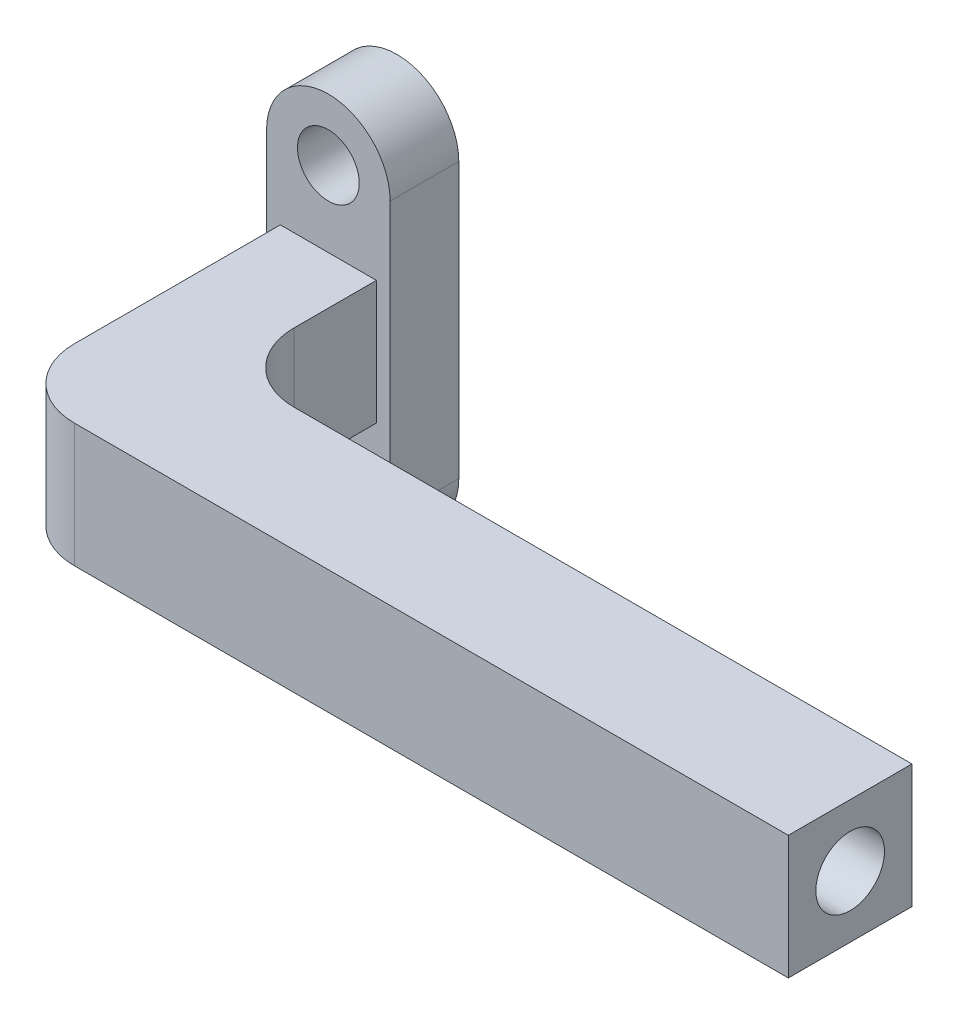
ISO-10303-21;
HEADER;
FILE_DESCRIPTION(('STEP AP214'),'2;1');
FILE_NAME('part.step','',(''),(''),'','','');
FILE_SCHEMA(('AUTOMOTIVE_DESIGN { 1 0 10303 214 1 1 1 1 }'));
ENDSEC;
DATA;
#1=APPLICATION_CONTEXT('core data for automotive mechanical design processes');
#2=APPLICATION_PROTOCOL_DEFINITION('international standard','automotive_design',2000,#1);
#3=PRODUCT_CONTEXT('',#1,'mechanical');
#4=PRODUCT('Part','Part','',(#3));
#5=PRODUCT_RELATED_PRODUCT_CATEGORY('part','',(#4));
#6=PRODUCT_DEFINITION_FORMATION('','',#4);
#7=PRODUCT_DEFINITION_CONTEXT('part definition',#1,'design');
#8=PRODUCT_DEFINITION('design','',#6,#7);
#9=PRODUCT_DEFINITION_SHAPE('','',#8);
#10=(LENGTH_UNIT() NAMED_UNIT(*) SI_UNIT(.MILLI.,.METRE.));
#11=(NAMED_UNIT(*) PLANE_ANGLE_UNIT() SI_UNIT($,.RADIAN.));
#12=(NAMED_UNIT(*) SI_UNIT($,.STERADIAN.) SOLID_ANGLE_UNIT());
#13=UNCERTAINTY_MEASURE_WITH_UNIT(LENGTH_MEASURE(1.E-05),#10,'distance_accuracy_value','');
#14=(GEOMETRIC_REPRESENTATION_CONTEXT(3) GLOBAL_UNCERTAINTY_ASSIGNED_CONTEXT((#13)) GLOBAL_UNIT_ASSIGNED_CONTEXT((#10,
#11,#12)) REPRESENTATION_CONTEXT('',''));
#15=CARTESIAN_POINT('',(0.,0.,0.));
#16=DIRECTION('',(0.,0.,1.));
#17=DIRECTION('',(1.,0.,0.));
#18=AXIS2_PLACEMENT_3D('',#15,#16,#17);
#19=CARTESIAN_POINT('',(3.5,-4.5,25.));
#20=DIRECTION('',(-1.,0.,0.));
#21=DIRECTION('',(0.,0.,1.));
#22=AXIS2_PLACEMENT_3D('',#19,#20,#21);
#23=PLANE('',#22);
#24=DIRECTION('',(0.,0.,-1.));
#25=VECTOR('',#24,1.);
#26=CARTESIAN_POINT('',(3.5,4.5,25.));
#27=LINE('',#26,#25);
#28=CARTESIAN_POINT('',(3.5,4.5,11.));
#29=VERTEX_POINT('',#28);
#30=CARTESIAN_POINT('',(3.5,4.5,5.));
#31=VERTEX_POINT('',#30);
#32=EDGE_CURVE('E219',#29,#31,#27,.T.);
#33=ORIENTED_EDGE('',*,*,#32,.F.);
#34=DIRECTION('',(0.,1.,0.));
#35=VECTOR('',#34,1.);
#36=CARTESIAN_POINT('',(3.5,-4.5,11.));
#37=LINE('',#36,#35);
#38=CARTESIAN_POINT('',(3.5,-4.5,11.));
#39=VERTEX_POINT('',#38);
#40=EDGE_CURVE('E268',#29,#39,#37,.F.);
#41=ORIENTED_EDGE('',*,*,#40,.T.);
#42=DIRECTION('',(0.,0.,-1.));
#43=VECTOR('',#42,1.);
#44=CARTESIAN_POINT('',(3.5,-4.5,25.));
#45=LINE('',#44,#43);
#46=CARTESIAN_POINT('',(3.5,-4.5,5.));
#47=VERTEX_POINT('',#46);
#48=EDGE_CURVE('E172',#39,#47,#45,.T.);
#49=ORIENTED_EDGE('',*,*,#48,.T.);
#50=DIRECTION('',(0.,1.,0.));
#51=VECTOR('',#50,1.);
#52=CARTESIAN_POINT('',(3.5,-4.5,5.));
#53=LINE('',#52,#51);
#54=EDGE_CURVE('E201',#47,#31,#53,.T.);
#55=ORIENTED_EDGE('',*,*,#54,.T.);
#56=EDGE_LOOP('',(#33,#41,#49,#55));
#57=FACE_BOUND('',#56,.T.);
#58=ADVANCED_FACE('F77',(#57),#23,.F.);
#59=CARTESIAN_POINT('',(0.,-10.,5.));
#60=DIRECTION('',(0.,0.,-1.));
#61=DIRECTION('',(-1.,0.,0.));
#62=AXIS2_PLACEMENT_3D('',#59,#60,#61);
#63=CYLINDRICAL_SURFACE('',#62,2.25);
#64=CARTESIAN_POINT('',(0.,-10.,5.));
#65=DIRECTION('',(0.,0.,1.));
#66=DIRECTION('',(1.,0.,0.));
#67=AXIS2_PLACEMENT_3D('',#64,#65,#66);
#68=CIRCLE('',#67,2.25);
#69=CARTESIAN_POINT('',(2.25,-10.,5.));
#70=VERTEX_POINT('',#69);
#71=EDGE_CURVE('E231',#70,#70,#68,.T.);
#72=ORIENTED_EDGE('',*,*,#71,.T.);
#73=EDGE_LOOP('',(#72));
#74=FACE_BOUND('',#73,.T.);
#75=CARTESIAN_POINT('',(0.,-10.,0.));
#76=DIRECTION('',(0.,0.,1.));
#77=DIRECTION('',(1.,0.,0.));
#78=AXIS2_PLACEMENT_3D('',#75,#76,#77);
#79=CIRCLE('',#78,2.25);
#80=CARTESIAN_POINT('',(2.25,-10.,0.));
#81=VERTEX_POINT('',#80);
#82=EDGE_CURVE('E226',#81,#81,#79,.T.);
#83=ORIENTED_EDGE('',*,*,#82,.F.);
#84=EDGE_LOOP('',(#83));
#85=FACE_BOUND('',#84,.T.);
#86=ADVANCED_FACE('F305',(#74,#85),#63,.F.);
#87=CARTESIAN_POINT('',(0.,-10.,5.));
#88=DIRECTION('',(0.,0.,-1.));
#89=DIRECTION('',(-1.,0.,0.));
#90=AXIS2_PLACEMENT_3D('',#87,#88,#89);
#91=CYLINDRICAL_SURFACE('',#90,4.5);
#92=CARTESIAN_POINT('',(0.,-10.,0.));
#93=DIRECTION('',(0.,0.,1.));
#94=DIRECTION('',(1.,0.,0.));
#95=AXIS2_PLACEMENT_3D('',#92,#93,#94);
#96=CIRCLE('',#95,4.5);
#97=CARTESIAN_POINT('',(-4.5,-10.,0.));
#98=VERTEX_POINT('',#97);
#99=CARTESIAN_POINT('',(4.5,-10.,0.));
#100=VERTEX_POINT('',#99);
#101=EDGE_CURVE('E238',#98,#100,#96,.T.);
#102=ORIENTED_EDGE('',*,*,#101,.T.);
#103=DIRECTION('',(0.,0.,-1.));
#104=VECTOR('',#103,1.);
#105=CARTESIAN_POINT('',(4.5,-10.,5.));
#106=LINE('',#105,#104);
#107=CARTESIAN_POINT('',(4.5,-10.,5.));
#108=VERTEX_POINT('',#107);
#109=EDGE_CURVE('E250',#108,#100,#106,.T.);
#110=ORIENTED_EDGE('',*,*,#109,.F.);
#111=CARTESIAN_POINT('',(0.,-10.,5.));
#112=DIRECTION('',(0.,0.,1.));
#113=DIRECTION('',(1.,0.,0.));
#114=AXIS2_PLACEMENT_3D('',#111,#112,#113);
#115=CIRCLE('',#114,4.5);
#116=CARTESIAN_POINT('',(-4.5,-10.,5.));
#117=VERTEX_POINT('',#116);
#118=EDGE_CURVE('E225',#117,#108,#115,.T.);
#119=ORIENTED_EDGE('',*,*,#118,.F.);
#120=DIRECTION('',(0.,0.,-1.));
#121=VECTOR('',#120,1.);
#122=CARTESIAN_POINT('',(-4.5,-10.,5.));
#123=LINE('',#122,#121);
#124=EDGE_CURVE('E252',#117,#98,#123,.T.);
#125=ORIENTED_EDGE('',*,*,#124,.T.);
#126=EDGE_LOOP('',(#102,#110,#119,#125));
#127=FACE_BOUND('',#126,.T.);
#128=ADVANCED_FACE('F312',(#127),#91,.T.);
#129=CARTESIAN_POINT('',(4.5,0.,5.));
#130=DIRECTION('',(1.,0.,0.));
#131=DIRECTION('',(0.,0.,-1.));
#132=AXIS2_PLACEMENT_3D('',#129,#130,#131);
#133=PLANE('',#132);
#134=DIRECTION('',(0.,-1.,0.));
#135=VECTOR('',#134,1.);
#136=CARTESIAN_POINT('',(4.5,0.,0.));
#137=LINE('',#136,#135);
#138=CARTESIAN_POINT('',(4.5,10.,0.));
#139=VERTEX_POINT('',#138);
#140=EDGE_CURVE('E242',#139,#100,#137,.T.);
#141=ORIENTED_EDGE('',*,*,#140,.F.);
#142=DIRECTION('',(0.,0.,-1.));
#143=VECTOR('',#142,1.);
#144=CARTESIAN_POINT('',(4.5,10.,5.));
#145=LINE('',#144,#143);
#146=CARTESIAN_POINT('',(4.5,10.,5.));
#147=VERTEX_POINT('',#146);
#148=EDGE_CURVE('E248',#147,#139,#145,.T.);
#149=ORIENTED_EDGE('',*,*,#148,.F.);
#150=DIRECTION('',(0.,-1.,0.));
#151=VECTOR('',#150,1.);
#152=CARTESIAN_POINT('',(4.5,0.,5.));
#153=LINE('',#152,#151);
#154=EDGE_CURVE('E228',#147,#108,#153,.T.);
#155=ORIENTED_EDGE('',*,*,#154,.T.);
#156=ORIENTED_EDGE('',*,*,#109,.T.);
#157=EDGE_LOOP('',(#141,#149,#155,#156));
#158=FACE_BOUND('',#157,.T.);
#159=ADVANCED_FACE('F327',(#158),#133,.T.);
#160=CARTESIAN_POINT('',(-4.5,0.,5.));
#161=DIRECTION('',(1.,0.,0.));
#162=DIRECTION('',(0.,0.,-1.));
#163=AXIS2_PLACEMENT_3D('',#160,#161,#162);
#164=PLANE('',#163);
#165=DIRECTION('',(0.,-1.,0.));
#166=VECTOR('',#165,1.);
#167=CARTESIAN_POINT('',(-4.5,0.,0.));
#168=LINE('',#167,#166);
#169=CARTESIAN_POINT('',(-4.5,10.,0.));
#170=VERTEX_POINT('',#169);
#171=EDGE_CURVE('E235',#170,#98,#168,.T.);
#172=ORIENTED_EDGE('',*,*,#171,.T.);
#173=ORIENTED_EDGE('',*,*,#124,.F.);
#174=DIRECTION('',(0.,-1.,0.));
#175=VECTOR('',#174,1.);
#176=CARTESIAN_POINT('',(-4.5,0.,5.));
#177=LINE('',#176,#175);
#178=CARTESIAN_POINT('',(-4.5,10.,5.));
#179=VERTEX_POINT('',#178);
#180=EDGE_CURVE('E222',#179,#117,#177,.T.);
#181=ORIENTED_EDGE('',*,*,#180,.F.);
#182=DIRECTION('',(0.,0.,-1.));
#183=VECTOR('',#182,1.);
#184=CARTESIAN_POINT('',(-4.5,10.,5.));
#185=LINE('',#184,#183);
#186=EDGE_CURVE('E234',#179,#170,#185,.T.);
#187=ORIENTED_EDGE('',*,*,#186,.T.);
#188=EDGE_LOOP('',(#172,#173,#181,#187));
#189=FACE_BOUND('',#188,.T.);
#190=ADVANCED_FACE('F324',(#189),#164,.F.);
#191=CARTESIAN_POINT('',(0.,0.,0.));
#192=DIRECTION('',(0.,0.,1.));
#193=DIRECTION('',(1.,0.,0.));
#194=AXIS2_PLACEMENT_3D('',#191,#192,#193);
#195=PLANE('',#194);
#196=ORIENTED_EDGE('',*,*,#171,.F.);
#197=CARTESIAN_POINT('',(0.,10.,0.));
#198=DIRECTION('',(0.,0.,1.));
#199=DIRECTION('',(1.,0.,0.));
#200=AXIS2_PLACEMENT_3D('',#197,#198,#199);
#201=CIRCLE('',#200,4.5);
#202=EDGE_CURVE('E259',#139,#170,#201,.T.);
#203=ORIENTED_EDGE('',*,*,#202,.F.);
#204=ORIENTED_EDGE('',*,*,#140,.T.);
#205=ORIENTED_EDGE('',*,*,#101,.F.);
#206=EDGE_LOOP('',(#196,#203,#204,#205));
#207=FACE_BOUND('',#206,.T.);
#208=ORIENTED_EDGE('',*,*,#82,.T.);
#209=EDGE_LOOP('',(#208));
#210=FACE_BOUND('',#209,.T.);
#211=CARTESIAN_POINT('',(0.,10.,0.));
#212=DIRECTION('',(0.,0.,1.));
#213=DIRECTION('',(1.,0.,0.));
#214=AXIS2_PLACEMENT_3D('',#211,#212,#213);
#215=CIRCLE('',#214,2.25);
#216=CARTESIAN_POINT('',(2.25,10.,0.));
#217=VERTEX_POINT('',#216);
#218=EDGE_CURVE('E221',#217,#217,#215,.T.);
#219=ORIENTED_EDGE('',*,*,#218,.T.);
#220=EDGE_LOOP('',(#219));
#221=FACE_BOUND('',#220,.T.);
#222=ADVANCED_FACE('F321',(#207,#210,#221),#195,.F.);
#223=CARTESIAN_POINT('',(0.,0.,5.));
#224=DIRECTION('',(0.,0.,1.));
#225=DIRECTION('',(1.,0.,0.));
#226=AXIS2_PLACEMENT_3D('',#223,#224,#225);
#227=PLANE('',#226);
#228=ORIENTED_EDGE('',*,*,#54,.F.);
#229=DIRECTION('',(1.,0.,0.));
#230=VECTOR('',#229,1.);
#231=CARTESIAN_POINT('',(-3.5,-4.5,5.));
#232=LINE('',#231,#230);
#233=CARTESIAN_POINT('',(-3.5,-4.5,5.));
#234=VERTEX_POINT('',#233);
#235=EDGE_CURVE('E202',#234,#47,#232,.T.);
#236=ORIENTED_EDGE('',*,*,#235,.F.);
#237=DIRECTION('',(0.,-1.,0.));
#238=VECTOR('',#237,1.);
#239=CARTESIAN_POINT('',(-3.5,-4.5,5.));
#240=LINE('',#239,#238);
#241=CARTESIAN_POINT('',(-3.5,4.5,5.));
#242=VERTEX_POINT('',#241);
#243=EDGE_CURVE('E209',#242,#234,#240,.T.);
#244=ORIENTED_EDGE('',*,*,#243,.F.);
#245=DIRECTION('',(-1.,0.,0.));
#246=VECTOR('',#245,1.);
#247=CARTESIAN_POINT('',(-3.5,4.5,5.));
#248=LINE('',#247,#246);
#249=EDGE_CURVE('E206',#31,#242,#248,.T.);
#250=ORIENTED_EDGE('',*,*,#249,.F.);
#251=EDGE_LOOP('',(#228,#236,#244,#250));
#252=FACE_BOUND('',#251,.T.);
#253=ORIENTED_EDGE('',*,*,#180,.T.);
#254=ORIENTED_EDGE('',*,*,#118,.T.);
#255=ORIENTED_EDGE('',*,*,#154,.F.);
#256=CARTESIAN_POINT('',(0.,10.,5.));
#257=DIRECTION('',(0.,0.,1.));
#258=DIRECTION('',(1.,0.,0.));
#259=AXIS2_PLACEMENT_3D('',#256,#257,#258);
#260=CIRCLE('',#259,4.5);
#261=EDGE_CURVE('E239',#147,#179,#260,.T.);
#262=ORIENTED_EDGE('',*,*,#261,.T.);
#263=EDGE_LOOP('',(#253,#254,#255,#262));
#264=FACE_BOUND('',#263,.T.);
#265=ORIENTED_EDGE('',*,*,#71,.F.);
#266=EDGE_LOOP('',(#265));
#267=FACE_BOUND('',#266,.T.);
#268=CARTESIAN_POINT('',(0.,10.,5.));
#269=DIRECTION('',(0.,0.,1.));
#270=DIRECTION('',(1.,0.,0.));
#271=AXIS2_PLACEMENT_3D('',#268,#269,#270);
#272=CIRCLE('',#271,2.25);
#273=CARTESIAN_POINT('',(2.25,10.,5.));
#274=VERTEX_POINT('',#273);
#275=EDGE_CURVE('E256',#274,#274,#272,.T.);
#276=ORIENTED_EDGE('',*,*,#275,.F.);
#277=EDGE_LOOP('',(#276));
#278=FACE_BOUND('',#277,.T.);
#279=ADVANCED_FACE('F292',(#252,#264,#267,#278),#227,.T.);
#280=CARTESIAN_POINT('',(0.,10.,5.));
#281=DIRECTION('',(0.,0.,-1.));
#282=DIRECTION('',(-1.,0.,0.));
#283=AXIS2_PLACEMENT_3D('',#280,#281,#282);
#284=CYLINDRICAL_SURFACE('',#283,2.25);
#285=ORIENTED_EDGE('',*,*,#275,.T.);
#286=EDGE_LOOP('',(#285));
#287=FACE_BOUND('',#286,.T.);
#288=ORIENTED_EDGE('',*,*,#218,.F.);
#289=EDGE_LOOP('',(#288));
#290=FACE_BOUND('',#289,.T.);
#291=ADVANCED_FACE('F320',(#287,#290),#284,.F.);
#292=CARTESIAN_POINT('',(0.,10.,5.));
#293=DIRECTION('',(0.,0.,-1.));
#294=DIRECTION('',(-1.,0.,0.));
#295=AXIS2_PLACEMENT_3D('',#292,#293,#294);
#296=CYLINDRICAL_SURFACE('',#295,4.5);
#297=ORIENTED_EDGE('',*,*,#202,.T.);
#298=ORIENTED_EDGE('',*,*,#186,.F.);
#299=ORIENTED_EDGE('',*,*,#261,.F.);
#300=ORIENTED_EDGE('',*,*,#148,.T.);
#301=EDGE_LOOP('',(#297,#298,#299,#300));
#302=FACE_BOUND('',#301,.T.);
#303=ADVANCED_FACE('F322',(#302),#296,.T.);
#304=CARTESIAN_POINT('',(-3.5,4.5,25.));
#305=DIRECTION('',(0.,-1.,0.));
#306=DIRECTION('',(0.,0.,-1.));
#307=AXIS2_PLACEMENT_3D('',#304,#305,#306);
#308=PLANE('',#307);
#309=DIRECTION('',(0.,0.,-1.));
#310=VECTOR('',#309,1.);
#311=CARTESIAN_POINT('',(-3.5,4.5,25.));
#312=LINE('',#311,#310);
#313=CARTESIAN_POINT('',(-3.5,4.5,20.));
#314=VERTEX_POINT('',#313);
#315=EDGE_CURVE('E217',#314,#242,#312,.T.);
#316=ORIENTED_EDGE('',*,*,#315,.F.);
#317=CARTESIAN_POINT('',(1.5,4.5,20.));
#318=DIRECTION('',(0.,-1.,0.));
#319=DIRECTION('',(0.,0.,-1.));
#320=AXIS2_PLACEMENT_3D('',#317,#318,#319);
#321=CIRCLE('',#320,5.);
#322=CARTESIAN_POINT('',(1.5,4.5,25.));
#323=VERTEX_POINT('',#322);
#324=EDGE_CURVE('E12',#314,#323,#321,.F.);
#325=ORIENTED_EDGE('',*,*,#324,.T.);
#326=DIRECTION('',(-1.,0.,0.));
#327=VECTOR('',#326,1.);
#328=CARTESIAN_POINT('',(-3.5,4.5,25.));
#329=LINE('',#328,#327);
#330=CARTESIAN_POINT('',(53.5,4.5,25.));
#331=VERTEX_POINT('',#330);
#332=EDGE_CURVE('E173',#331,#323,#329,.T.);
#333=ORIENTED_EDGE('',*,*,#332,.F.);
#334=DIRECTION('',(0.,0.,1.));
#335=VECTOR('',#334,1.);
#336=CARTESIAN_POINT('',(53.5,4.5,25.));
#337=LINE('',#336,#335);
#338=CARTESIAN_POINT('',(53.5,4.5,16.));
#339=VERTEX_POINT('',#338);
#340=EDGE_CURVE('E187',#339,#331,#337,.T.);
#341=ORIENTED_EDGE('',*,*,#340,.F.);
#342=DIRECTION('',(-1.,0.,0.));
#343=VECTOR('',#342,1.);
#344=CARTESIAN_POINT('',(53.5,4.5,16.));
#345=LINE('',#344,#343);
#346=CARTESIAN_POINT('',(8.5,4.5,16.));
#347=VERTEX_POINT('',#346);
#348=EDGE_CURVE('E197',#339,#347,#345,.T.);
#349=ORIENTED_EDGE('',*,*,#348,.T.);
#350=CARTESIAN_POINT('',(8.5,4.5,11.));
#351=DIRECTION('',(0.,-1.,0.));
#352=DIRECTION('',(0.,0.,-1.));
#353=AXIS2_PLACEMENT_3D('',#350,#351,#352);
#354=CIRCLE('',#353,5.);
#355=EDGE_CURVE('E270',#347,#29,#354,.T.);
#356=ORIENTED_EDGE('',*,*,#355,.T.);
#357=ORIENTED_EDGE('',*,*,#32,.T.);
#358=ORIENTED_EDGE('',*,*,#249,.T.);
#359=EDGE_LOOP('',(#316,#325,#333,#341,#349,#356,#357,#358));
#360=FACE_BOUND('',#359,.T.);
#361=ADVANCED_FACE('F286',(#360),#308,.F.);
#362=CARTESIAN_POINT('',(-3.5,-4.5,25.));
#363=DIRECTION('',(1.,0.,0.));
#364=DIRECTION('',(0.,0.,-1.));
#365=AXIS2_PLACEMENT_3D('',#362,#363,#364);
#366=PLANE('',#365);
#367=DIRECTION('',(0.,0.,-1.));
#368=VECTOR('',#367,1.);
#369=CARTESIAN_POINT('',(-3.5,-4.5,25.));
#370=LINE('',#369,#368);
#371=CARTESIAN_POINT('',(-3.5,-4.5,20.));
#372=VERTEX_POINT('',#371);
#373=EDGE_CURVE('E215',#372,#234,#370,.T.);
#374=ORIENTED_EDGE('',*,*,#373,.F.);
#375=DIRECTION('',(0.,-1.,0.));
#376=VECTOR('',#375,1.);
#377=CARTESIAN_POINT('',(-3.5,-4.5,20.));
#378=LINE('',#377,#376);
#379=EDGE_CURVE('E85',#372,#314,#378,.F.);
#380=ORIENTED_EDGE('',*,*,#379,.T.);
#381=ORIENTED_EDGE('',*,*,#315,.T.);
#382=ORIENTED_EDGE('',*,*,#243,.T.);
#383=EDGE_LOOP('',(#374,#380,#381,#382));
#384=FACE_BOUND('',#383,.T.);
#385=ADVANCED_FACE('F295',(#384),#366,.F.);
#386=CARTESIAN_POINT('',(-3.5,-4.5,25.));
#387=DIRECTION('',(0.,1.,0.));
#388=DIRECTION('',(0.,0.,1.));
#389=AXIS2_PLACEMENT_3D('',#386,#387,#388);
#390=PLANE('',#389);
#391=DIRECTION('',(1.,0.,0.));
#392=VECTOR('',#391,1.);
#393=CARTESIAN_POINT('',(-3.5,-4.5,25.));
#394=LINE('',#393,#392);
#395=CARTESIAN_POINT('',(1.5,-4.5,25.));
#396=VERTEX_POINT('',#395);
#397=CARTESIAN_POINT('',(53.5,-4.5,25.));
#398=VERTEX_POINT('',#397);
#399=EDGE_CURVE('E164',#396,#398,#394,.T.);
#400=ORIENTED_EDGE('',*,*,#399,.F.);
#401=CARTESIAN_POINT('',(1.5,-4.5,20.));
#402=DIRECTION('',(0.,1.,0.));
#403=DIRECTION('',(0.,0.,1.));
#404=AXIS2_PLACEMENT_3D('',#401,#402,#403);
#405=CIRCLE('',#404,5.);
#406=EDGE_CURVE('E99',#396,#372,#405,.F.);
#407=ORIENTED_EDGE('',*,*,#406,.T.);
#408=ORIENTED_EDGE('',*,*,#373,.T.);
#409=ORIENTED_EDGE('',*,*,#235,.T.);
#410=ORIENTED_EDGE('',*,*,#48,.F.);
#411=CARTESIAN_POINT('',(8.5,-4.5,11.));
#412=DIRECTION('',(0.,1.,0.));
#413=DIRECTION('',(0.,0.,1.));
#414=AXIS2_PLACEMENT_3D('',#411,#412,#413);
#415=CIRCLE('',#414,5.);
#416=CARTESIAN_POINT('',(8.5,-4.5,16.));
#417=VERTEX_POINT('',#416);
#418=EDGE_CURVE('E272',#39,#417,#415,.T.);
#419=ORIENTED_EDGE('',*,*,#418,.T.);
#420=DIRECTION('',(-1.,0.,0.));
#421=VECTOR('',#420,1.);
#422=CARTESIAN_POINT('',(53.5,-4.5,16.));
#423=LINE('',#422,#421);
#424=CARTESIAN_POINT('',(53.5,-4.5,16.));
#425=VERTEX_POINT('',#424);
#426=EDGE_CURVE('E179',#425,#417,#423,.T.);
#427=ORIENTED_EDGE('',*,*,#426,.F.);
#428=DIRECTION('',(0.,0.,-1.));
#429=VECTOR('',#428,1.);
#430=CARTESIAN_POINT('',(53.5,-4.5,25.));
#431=LINE('',#430,#429);
#432=EDGE_CURVE('E176',#398,#425,#431,.T.);
#433=ORIENTED_EDGE('',*,*,#432,.F.);
#434=EDGE_LOOP('',(#400,#407,#408,#409,#410,#419,#427,#433));
#435=FACE_BOUND('',#434,.T.);
#436=ADVANCED_FACE('F177',(#435),#390,.F.);
#437=CARTESIAN_POINT('',(0.,0.,25.));
#438=DIRECTION('',(0.,0.,-1.));
#439=DIRECTION('',(-1.,0.,0.));
#440=AXIS2_PLACEMENT_3D('',#437,#438,#439);
#441=PLANE('',#440);
#442=ORIENTED_EDGE('',*,*,#332,.T.);
#443=DIRECTION('',(0.,-1.,0.));
#444=VECTOR('',#443,1.);
#445=CARTESIAN_POINT('',(1.5,0.,25.));
#446=LINE('',#445,#444);
#447=EDGE_CURVE('E171',#323,#396,#446,.T.);
#448=ORIENTED_EDGE('',*,*,#447,.T.);
#449=ORIENTED_EDGE('',*,*,#399,.T.);
#450=DIRECTION('',(0.,-1.,0.));
#451=VECTOR('',#450,1.);
#452=CARTESIAN_POINT('',(53.5,4.5,25.));
#453=LINE('',#452,#451);
#454=EDGE_CURVE('E169',#331,#398,#453,.T.);
#455=ORIENTED_EDGE('',*,*,#454,.F.);
#456=EDGE_LOOP('',(#442,#448,#449,#455));
#457=FACE_BOUND('',#456,.T.);
#458=ADVANCED_FACE('F167',(#457),#441,.F.);
#459=CARTESIAN_POINT('',(53.5,4.5,16.));
#460=DIRECTION('',(0.,0.,1.));
#461=DIRECTION('',(1.,0.,0.));
#462=AXIS2_PLACEMENT_3D('',#459,#460,#461);
#463=PLANE('',#462);
#464=ORIENTED_EDGE('',*,*,#426,.T.);
#465=DIRECTION('',(0.,1.,0.));
#466=VECTOR('',#465,1.);
#467=CARTESIAN_POINT('',(8.5,4.5,16.));
#468=LINE('',#467,#466);
#469=EDGE_CURVE('E255',#417,#347,#468,.T.);
#470=ORIENTED_EDGE('',*,*,#469,.T.);
#471=ORIENTED_EDGE('',*,*,#348,.F.);
#472=DIRECTION('',(0.,1.,0.));
#473=VECTOR('',#472,1.);
#474=CARTESIAN_POINT('',(53.5,4.5,16.));
#475=LINE('',#474,#473);
#476=EDGE_CURVE('E182',#425,#339,#475,.T.);
#477=ORIENTED_EDGE('',*,*,#476,.F.);
#478=EDGE_LOOP('',(#464,#470,#471,#477));
#479=FACE_BOUND('',#478,.T.);
#480=ADVANCED_FACE('F281',(#479),#463,.F.);
#481=CARTESIAN_POINT('',(53.5,0.,0.));
#482=DIRECTION('',(1.,0.,0.));
#483=DIRECTION('',(0.,0.,-1.));
#484=AXIS2_PLACEMENT_3D('',#481,#482,#483);
#485=PLANE('',#484);
#486=CARTESIAN_POINT('',(53.5,0.,20.5));
#487=DIRECTION('',(1.,0.,0.));
#488=DIRECTION('',(0.,0.,-1.));
#489=AXIS2_PLACEMENT_3D('',#486,#487,#488);
#490=CIRCLE('',#489,2.5);
#491=CARTESIAN_POINT('',(53.5,0.,18.));
#492=VERTEX_POINT('',#491);
#493=EDGE_CURVE('E191',#492,#492,#490,.T.);
#494=ORIENTED_EDGE('',*,*,#493,.F.);
#495=EDGE_LOOP('',(#494));
#496=FACE_BOUND('',#495,.T.);
#497=ORIENTED_EDGE('',*,*,#454,.T.);
#498=ORIENTED_EDGE('',*,*,#432,.T.);
#499=ORIENTED_EDGE('',*,*,#476,.T.);
#500=ORIENTED_EDGE('',*,*,#340,.T.);
#501=EDGE_LOOP('',(#497,#498,#499,#500));
#502=FACE_BOUND('',#501,.T.);
#503=ADVANCED_FACE('F185',(#496,#502),#485,.T.);
#504=CARTESIAN_POINT('',(28.5,0.,20.5));
#505=DIRECTION('',(1.,0.,0.));
#506=DIRECTION('',(0.,0.,-1.));
#507=AXIS2_PLACEMENT_3D('',#504,#505,#506);
#508=CYLINDRICAL_SURFACE('',#507,2.5);
#509=CARTESIAN_POINT('',(28.5,0.,20.5));
#510=DIRECTION('',(1.,0.,0.));
#511=DIRECTION('',(0.,0.,-1.));
#512=AXIS2_PLACEMENT_3D('',#509,#510,#511);
#513=CIRCLE('',#512,2.5);
#514=CARTESIAN_POINT('',(28.5,0.,18.));
#515=VERTEX_POINT('',#514);
#516=EDGE_CURVE('E188',#515,#515,#513,.T.);
#517=ORIENTED_EDGE('',*,*,#516,.F.);
#518=EDGE_LOOP('',(#517));
#519=FACE_BOUND('',#518,.T.);
#520=ORIENTED_EDGE('',*,*,#493,.T.);
#521=EDGE_LOOP('',(#520));
#522=FACE_BOUND('',#521,.T.);
#523=ADVANCED_FACE('F375',(#519,#522),#508,.F.);
#524=CARTESIAN_POINT('',(28.5,0.,20.5));
#525=DIRECTION('',(1.,0.,0.));
#526=DIRECTION('',(0.,0.,-1.));
#527=AXIS2_PLACEMENT_3D('',#524,#525,#526);
#528=PLANE('',#527);
#529=ORIENTED_EDGE('',*,*,#516,.T.);
#530=EDGE_LOOP('',(#529));
#531=FACE_BOUND('',#530,.T.);
#532=ADVANCED_FACE('F303',(#531),#528,.T.);
#533=CARTESIAN_POINT('',(8.5,4.5,11.));
#534=DIRECTION('',(0.,-1.,0.));
#535=DIRECTION('',(0.,0.,-1.));
#536=AXIS2_PLACEMENT_3D('',#533,#534,#535);
#537=CYLINDRICAL_SURFACE('',#536,5.);
#538=ORIENTED_EDGE('',*,*,#418,.F.);
#539=ORIENTED_EDGE('',*,*,#40,.F.);
#540=ORIENTED_EDGE('',*,*,#355,.F.);
#541=ORIENTED_EDGE('',*,*,#469,.F.);
#542=EDGE_LOOP('',(#538,#539,#540,#541));
#543=FACE_BOUND('',#542,.T.);
#544=ADVANCED_FACE('F283',(#543),#537,.F.);
#545=CARTESIAN_POINT('',(1.5,0.,20.));
#546=DIRECTION('',(0.,-1.,0.));
#547=DIRECTION('',(0.,0.,-1.));
#548=AXIS2_PLACEMENT_3D('',#545,#546,#547);
#549=CYLINDRICAL_SURFACE('',#548,5.);
#550=ORIENTED_EDGE('',*,*,#324,.F.);
#551=ORIENTED_EDGE('',*,*,#379,.F.);
#552=ORIENTED_EDGE('',*,*,#406,.F.);
#553=ORIENTED_EDGE('',*,*,#447,.F.);
#554=EDGE_LOOP('',(#550,#551,#552,#553));
#555=FACE_BOUND('',#554,.T.);
#556=ADVANCED_FACE('F79',(#555),#549,.T.);
#557=CLOSED_SHELL('',(#58,#86,#128,#159,#190,#222,#279,#291,#303,#361,#385,#436,#458,#480,#503,
#523,#532,#544,#556));
#558=MANIFOLD_SOLID_BREP('B2',#557);
#559=ADVANCED_BREP_SHAPE_REPRESENTATION('',(#18,#558),#14);
#560=SHAPE_DEFINITION_REPRESENTATION(#9,#559);
ENDSEC;
END-ISO-10303-21;
